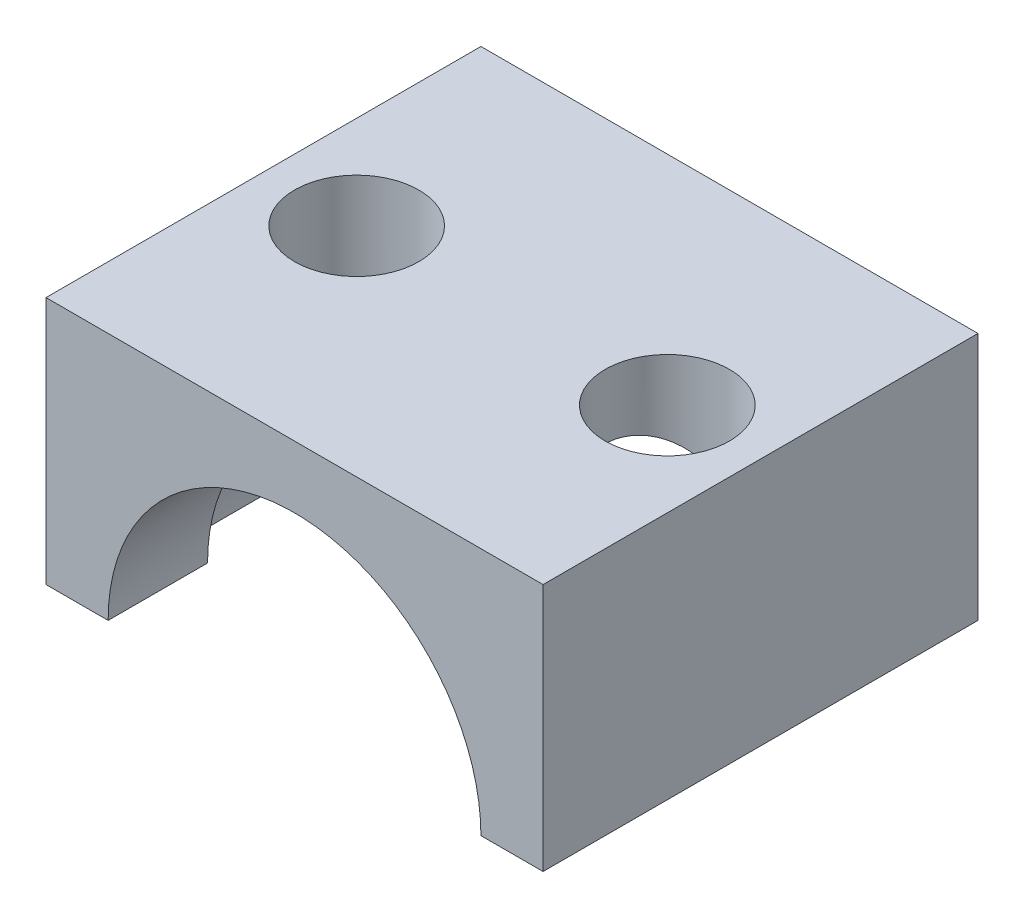
ISO-10303-21;
HEADER;
FILE_DESCRIPTION(('STEP AP214'),'2;1');
FILE_NAME('part.step','',(''),(''),'','','');
FILE_SCHEMA(('AUTOMOTIVE_DESIGN { 1 0 10303 214 1 1 1 1 }'));
ENDSEC;
DATA;
#1=APPLICATION_CONTEXT('core data for automotive mechanical design processes');
#2=APPLICATION_PROTOCOL_DEFINITION('international standard','automotive_design',2000,#1);
#3=PRODUCT_CONTEXT('',#1,'mechanical');
#4=PRODUCT('Part','Part','',(#3));
#5=PRODUCT_RELATED_PRODUCT_CATEGORY('part','',(#4));
#6=PRODUCT_DEFINITION_FORMATION('','',#4);
#7=PRODUCT_DEFINITION_CONTEXT('part definition',#1,'design');
#8=PRODUCT_DEFINITION('design','',#6,#7);
#9=PRODUCT_DEFINITION_SHAPE('','',#8);
#10=(LENGTH_UNIT() NAMED_UNIT(*) SI_UNIT(.MILLI.,.METRE.));
#11=(NAMED_UNIT(*) PLANE_ANGLE_UNIT() SI_UNIT($,.RADIAN.));
#12=(NAMED_UNIT(*) SI_UNIT($,.STERADIAN.) SOLID_ANGLE_UNIT());
#13=UNCERTAINTY_MEASURE_WITH_UNIT(LENGTH_MEASURE(1.E-05),#10,'distance_accuracy_value','');
#14=(GEOMETRIC_REPRESENTATION_CONTEXT(3) GLOBAL_UNCERTAINTY_ASSIGNED_CONTEXT((#13)) GLOBAL_UNIT_ASSIGNED_CONTEXT((#10,
#11,#12)) REPRESENTATION_CONTEXT('',''));
#15=CARTESIAN_POINT('',(0.,0.,0.));
#16=DIRECTION('',(0.,0.,1.));
#17=DIRECTION('',(1.,0.,0.));
#18=AXIS2_PLACEMENT_3D('',#15,#16,#17);
#19=CARTESIAN_POINT('',(0.,0.,14.));
#20=DIRECTION('',(0.,0.,-1.));
#21=DIRECTION('',(-1.,0.,0.));
#22=AXIS2_PLACEMENT_3D('',#19,#20,#21);
#23=CYLINDRICAL_SURFACE('',#22,6.);
#24=CARTESIAN_POINT('',(0.,0.,3.2));
#25=DIRECTION('',(0.,0.,1.));
#26=DIRECTION('',(1.,0.,0.));
#27=AXIS2_PLACEMENT_3D('',#24,#25,#26);
#28=CIRCLE('',#27,6.);
#29=CARTESIAN_POINT('',(-6.,0.,3.2));
#30=VERTEX_POINT('',#29);
#31=CARTESIAN_POINT('',(6.,0.,3.2));
#32=VERTEX_POINT('',#31);
#33=EDGE_CURVE('E215',#30,#32,#28,.F.);
#34=ORIENTED_EDGE('',*,*,#33,.F.);
#35=DIRECTION('',(0.,0.,-1.));
#36=VECTOR('',#35,1.);
#37=CARTESIAN_POINT('',(-6.,0.,14.));
#38=LINE('',#37,#36);
#39=CARTESIAN_POINT('',(-6.,0.,0.));
#40=VERTEX_POINT('',#39);
#41=EDGE_CURVE('E202',#30,#40,#38,.T.);
#42=ORIENTED_EDGE('',*,*,#41,.T.);
#43=CARTESIAN_POINT('',(0.,0.,0.));
#44=DIRECTION('',(0.,0.,-1.));
#45=DIRECTION('',(1.,0.,0.));
#46=AXIS2_PLACEMENT_3D('',#43,#44,#45);
#47=CIRCLE('',#46,6.);
#48=CARTESIAN_POINT('',(6.,0.,0.));
#49=VERTEX_POINT('',#48);
#50=EDGE_CURVE('E221',#40,#49,#47,.T.);
#51=ORIENTED_EDGE('',*,*,#50,.T.);
#52=DIRECTION('',(0.,0.,-1.));
#53=VECTOR('',#52,1.);
#54=CARTESIAN_POINT('',(6.,0.,14.));
#55=LINE('',#54,#53);
#56=EDGE_CURVE('E217',#32,#49,#55,.T.);
#57=ORIENTED_EDGE('',*,*,#56,.F.);
#58=EDGE_LOOP('',(#34,#42,#51,#57));
#59=FACE_BOUND('',#58,.T.);
#60=ADVANCED_FACE('F31',(#59),#23,.F.);
#61=CARTESIAN_POINT('',(8.,8.,14.));
#62=DIRECTION('',(0.,-1.,0.));
#63=DIRECTION('',(0.,0.,-1.));
#64=AXIS2_PLACEMENT_3D('',#61,#62,#63);
#65=PLANE('',#64);
#66=CARTESIAN_POINT('',(5.,8.,7.));
#67=DIRECTION('',(0.,1.,0.));
#68=DIRECTION('',(0.,0.,1.));
#69=AXIS2_PLACEMENT_3D('',#66,#67,#68);
#70=CIRCLE('',#69,2.);
#71=CARTESIAN_POINT('',(5.,8.,9.));
#72=VERTEX_POINT('',#71);
#73=EDGE_CURVE('E134',#72,#72,#70,.T.);
#74=ORIENTED_EDGE('',*,*,#73,.F.);
#75=EDGE_LOOP('',(#74));
#76=FACE_BOUND('',#75,.T.);
#77=CARTESIAN_POINT('',(-5.,8.,7.));
#78=DIRECTION('',(0.,1.,0.));
#79=DIRECTION('',(0.,0.,1.));
#80=AXIS2_PLACEMENT_3D('',#77,#78,#79);
#81=CIRCLE('',#80,2.);
#82=CARTESIAN_POINT('',(-5.,8.,9.));
#83=VERTEX_POINT('',#82);
#84=EDGE_CURVE('E133',#83,#83,#81,.T.);
#85=ORIENTED_EDGE('',*,*,#84,.F.);
#86=EDGE_LOOP('',(#85));
#87=FACE_BOUND('',#86,.T.);
#88=DIRECTION('',(-1.,0.,0.));
#89=VECTOR('',#88,1.);
#90=CARTESIAN_POINT('',(8.,8.,0.));
#91=LINE('',#90,#89);
#92=CARTESIAN_POINT('',(8.,8.,0.));
#93=VERTEX_POINT('',#92);
#94=CARTESIAN_POINT('',(-8.,8.,0.));
#95=VERTEX_POINT('',#94);
#96=EDGE_CURVE('E245',#93,#95,#91,.T.);
#97=ORIENTED_EDGE('',*,*,#96,.T.);
#98=DIRECTION('',(0.,0.,-1.));
#99=VECTOR('',#98,1.);
#100=CARTESIAN_POINT('',(-8.,8.,14.));
#101=LINE('',#100,#99);
#102=CARTESIAN_POINT('',(-8.,8.,14.));
#103=VERTEX_POINT('',#102);
#104=EDGE_CURVE('E205',#103,#95,#101,.T.);
#105=ORIENTED_EDGE('',*,*,#104,.F.);
#106=DIRECTION('',(-1.,0.,0.));
#107=VECTOR('',#106,1.);
#108=CARTESIAN_POINT('',(8.,8.,14.));
#109=LINE('',#108,#107);
#110=CARTESIAN_POINT('',(8.,8.,14.));
#111=VERTEX_POINT('',#110);
#112=EDGE_CURVE('E236',#111,#103,#109,.T.);
#113=ORIENTED_EDGE('',*,*,#112,.F.);
#114=DIRECTION('',(0.,0.,-1.));
#115=VECTOR('',#114,1.);
#116=CARTESIAN_POINT('',(8.,8.,14.));
#117=LINE('',#116,#115);
#118=EDGE_CURVE('E225',#111,#93,#117,.T.);
#119=ORIENTED_EDGE('',*,*,#118,.T.);
#120=EDGE_LOOP('',(#97,#105,#113,#119));
#121=FACE_BOUND('',#120,.T.);
#122=ADVANCED_FACE('F33',(#76,#87,#121),#65,.F.);
#123=CARTESIAN_POINT('',(-8.,0.,14.));
#124=DIRECTION('',(1.,0.,0.));
#125=DIRECTION('',(0.,0.,-1.));
#126=AXIS2_PLACEMENT_3D('',#123,#124,#125);
#127=PLANE('',#126);
#128=DIRECTION('',(0.,-1.,0.));
#129=VECTOR('',#128,1.);
#130=CARTESIAN_POINT('',(-8.,0.,0.));
#131=LINE('',#130,#129);
#132=CARTESIAN_POINT('',(-8.,0.,0.));
#133=VERTEX_POINT('',#132);
#134=EDGE_CURVE('E243',#95,#133,#131,.T.);
#135=ORIENTED_EDGE('',*,*,#134,.T.);
#136=DIRECTION('',(0.,0.,-1.));
#137=VECTOR('',#136,1.);
#138=CARTESIAN_POINT('',(-8.,0.,14.));
#139=LINE('',#138,#137);
#140=CARTESIAN_POINT('',(-8.,0.,14.));
#141=VERTEX_POINT('',#140);
#142=EDGE_CURVE('E201',#141,#133,#139,.T.);
#143=ORIENTED_EDGE('',*,*,#142,.F.);
#144=DIRECTION('',(0.,-1.,0.));
#145=VECTOR('',#144,1.);
#146=CARTESIAN_POINT('',(-8.,0.,14.));
#147=LINE('',#146,#145);
#148=EDGE_CURVE('E254',#103,#141,#147,.T.);
#149=ORIENTED_EDGE('',*,*,#148,.F.);
#150=ORIENTED_EDGE('',*,*,#104,.T.);
#151=EDGE_LOOP('',(#135,#143,#149,#150));
#152=FACE_BOUND('',#151,.T.);
#153=ADVANCED_FACE('F176',(#152),#127,.F.);
#154=CARTESIAN_POINT('',(-6.,0.,14.));
#155=DIRECTION('',(0.,1.,0.));
#156=DIRECTION('',(-1.,0.,0.));
#157=AXIS2_PLACEMENT_3D('',#154,#155,#156);
#158=PLANE('',#157);
#159=DIRECTION('',(0.,0.,-1.));
#160=VECTOR('',#159,1.);
#161=CARTESIAN_POINT('',(-6.9885699723544,0.,10.8));
#162=LINE('',#161,#160);
#163=CARTESIAN_POINT('',(-6.9885699723544,0.,6.78648310359493));
#164=VERTEX_POINT('',#163);
#165=CARTESIAN_POINT('',(-6.9885699723544,0.,3.2));
#166=VERTEX_POINT('',#165);
#167=EDGE_CURVE('E260',#164,#166,#162,.T.);
#168=ORIENTED_EDGE('',*,*,#167,.F.);
#169=CARTESIAN_POINT('',(-5.,0.,7.));
#170=DIRECTION('',(0.,1.,0.));
#171=DIRECTION('',(0.,0.,1.));
#172=AXIS2_PLACEMENT_3D('',#169,#170,#171);
#173=CIRCLE('',#172,2.);
#174=CARTESIAN_POINT('',(-6.98856997235439,0.,7.21351689640507));
#175=VERTEX_POINT('',#174);
#176=EDGE_CURVE('E56',#164,#175,#173,.T.);
#177=ORIENTED_EDGE('',*,*,#176,.T.);
#178=CARTESIAN_POINT('',(-6.9885699723544,0.,10.8));
#179=VERTEX_POINT('',#178);
#180=EDGE_CURVE('E247',#179,#175,#162,.T.);
#181=ORIENTED_EDGE('',*,*,#180,.F.);
#182=DIRECTION('',(1.,0.,0.));
#183=VECTOR('',#182,1.);
#184=CARTESIAN_POINT('',(-6.,0.,10.8));
#185=LINE('',#184,#183);
#186=CARTESIAN_POINT('',(-6.,0.,10.8));
#187=VERTEX_POINT('',#186);
#188=EDGE_CURVE('E261',#179,#187,#185,.T.);
#189=ORIENTED_EDGE('',*,*,#188,.T.);
#190=CARTESIAN_POINT('',(-6.,0.,14.));
#191=VERTEX_POINT('',#190);
#192=EDGE_CURVE('E194',#191,#187,#38,.T.);
#193=ORIENTED_EDGE('',*,*,#192,.F.);
#194=DIRECTION('',(1.,0.,0.));
#195=VECTOR('',#194,1.);
#196=CARTESIAN_POINT('',(-6.,0.,14.));
#197=LINE('',#196,#195);
#198=EDGE_CURVE('E252',#141,#191,#197,.T.);
#199=ORIENTED_EDGE('',*,*,#198,.F.);
#200=ORIENTED_EDGE('',*,*,#142,.T.);
#201=DIRECTION('',(1.,0.,0.));
#202=VECTOR('',#201,1.);
#203=CARTESIAN_POINT('',(-6.,0.,0.));
#204=LINE('',#203,#202);
#205=EDGE_CURVE('E240',#133,#40,#204,.T.);
#206=ORIENTED_EDGE('',*,*,#205,.T.);
#207=ORIENTED_EDGE('',*,*,#41,.F.);
#208=DIRECTION('',(1.,0.,0.));
#209=VECTOR('',#208,1.);
#210=CARTESIAN_POINT('',(-6.,0.,3.2));
#211=LINE('',#210,#209);
#212=EDGE_CURVE('E264',#166,#30,#211,.T.);
#213=ORIENTED_EDGE('',*,*,#212,.F.);
#214=EDGE_LOOP('',(#168,#177,#181,#189,#193,#199,#200,#206,#207,#213));
#215=FACE_BOUND('',#214,.T.);
#216=ADVANCED_FACE('F182',(#215),#158,.F.);
#217=ORIENTED_EDGE('',*,*,#192,.T.);
#218=CARTESIAN_POINT('',(0.,0.,10.8));
#219=DIRECTION('',(0.,0.,1.));
#220=DIRECTION('',(1.,0.,0.));
#221=AXIS2_PLACEMENT_3D('',#218,#219,#220);
#222=CIRCLE('',#221,6.);
#223=CARTESIAN_POINT('',(6.,0.,10.8));
#224=VERTEX_POINT('',#223);
#225=EDGE_CURVE('E196',#187,#224,#222,.F.);
#226=ORIENTED_EDGE('',*,*,#225,.T.);
#227=CARTESIAN_POINT('',(6.,0.,14.));
#228=VERTEX_POINT('',#227);
#229=EDGE_CURVE('E207',#228,#224,#55,.T.);
#230=ORIENTED_EDGE('',*,*,#229,.F.);
#231=CARTESIAN_POINT('',(0.,0.,14.));
#232=DIRECTION('',(0.,0.,-1.));
#233=DIRECTION('',(1.,0.,0.));
#234=AXIS2_PLACEMENT_3D('',#231,#232,#233);
#235=CIRCLE('',#234,6.);
#236=EDGE_CURVE('E198',#191,#228,#235,.T.);
#237=ORIENTED_EDGE('',*,*,#236,.F.);
#238=EDGE_LOOP('',(#217,#226,#230,#237));
#239=FACE_BOUND('',#238,.T.);
#240=ADVANCED_FACE('F172',(#239),#23,.F.);
#241=CARTESIAN_POINT('',(8.,0.,14.));
#242=DIRECTION('',(0.,1.,0.));
#243=DIRECTION('',(-1.,0.,0.));
#244=AXIS2_PLACEMENT_3D('',#241,#242,#243);
#245=PLANE('',#244);
#246=DIRECTION('',(0.,0.,-1.));
#247=VECTOR('',#246,1.);
#248=CARTESIAN_POINT('',(6.98856997235439,0.,10.8));
#249=LINE('',#248,#247);
#250=CARTESIAN_POINT('',(6.98856997235439,0.,7.21351689640506));
#251=VERTEX_POINT('',#250);
#252=CARTESIAN_POINT('',(6.9885699723544,0.,10.8));
#253=VERTEX_POINT('',#252);
#254=EDGE_CURVE('E132',#251,#253,#249,.F.);
#255=ORIENTED_EDGE('',*,*,#254,.F.);
#256=CARTESIAN_POINT('',(5.,0.,7.));
#257=DIRECTION('',(0.,1.,0.));
#258=DIRECTION('',(0.,0.,1.));
#259=AXIS2_PLACEMENT_3D('',#256,#257,#258);
#260=CIRCLE('',#259,2.);
#261=CARTESIAN_POINT('',(6.98856997235439,0.,6.78648310359494));
#262=VERTEX_POINT('',#261);
#263=EDGE_CURVE('E49',#251,#262,#260,.T.);
#264=ORIENTED_EDGE('',*,*,#263,.T.);
#265=CARTESIAN_POINT('',(6.9885699723544,0.,3.2));
#266=VERTEX_POINT('',#265);
#267=EDGE_CURVE('E130',#266,#262,#249,.F.);
#268=ORIENTED_EDGE('',*,*,#267,.F.);
#269=DIRECTION('',(1.,0.,0.));
#270=VECTOR('',#269,1.);
#271=CARTESIAN_POINT('',(8.,0.,3.2));
#272=LINE('',#271,#270);
#273=EDGE_CURVE('E143',#32,#266,#272,.T.);
#274=ORIENTED_EDGE('',*,*,#273,.F.);
#275=ORIENTED_EDGE('',*,*,#56,.T.);
#276=DIRECTION('',(1.,0.,0.));
#277=VECTOR('',#276,1.);
#278=CARTESIAN_POINT('',(8.,0.,0.));
#279=LINE('',#278,#277);
#280=CARTESIAN_POINT('',(8.,0.,0.));
#281=VERTEX_POINT('',#280);
#282=EDGE_CURVE('E237',#49,#281,#279,.T.);
#283=ORIENTED_EDGE('',*,*,#282,.T.);
#284=DIRECTION('',(0.,0.,-1.));
#285=VECTOR('',#284,1.);
#286=CARTESIAN_POINT('',(8.,0.,14.));
#287=LINE('',#286,#285);
#288=CARTESIAN_POINT('',(8.,0.,14.));
#289=VERTEX_POINT('',#288);
#290=EDGE_CURVE('E223',#289,#281,#287,.T.);
#291=ORIENTED_EDGE('',*,*,#290,.F.);
#292=DIRECTION('',(1.,0.,0.));
#293=VECTOR('',#292,1.);
#294=CARTESIAN_POINT('',(8.,0.,14.));
#295=LINE('',#294,#293);
#296=EDGE_CURVE('E249',#228,#289,#295,.T.);
#297=ORIENTED_EDGE('',*,*,#296,.F.);
#298=ORIENTED_EDGE('',*,*,#229,.T.);
#299=DIRECTION('',(1.,0.,0.));
#300=VECTOR('',#299,1.);
#301=CARTESIAN_POINT('',(8.,0.,10.8));
#302=LINE('',#301,#300);
#303=EDGE_CURVE('E140',#224,#253,#302,.T.);
#304=ORIENTED_EDGE('',*,*,#303,.T.);
#305=EDGE_LOOP('',(#255,#264,#268,#274,#275,#283,#291,#297,#298,#304));
#306=FACE_BOUND('',#305,.T.);
#307=ADVANCED_FACE('F128',(#306),#245,.F.);
#308=CARTESIAN_POINT('',(8.,8.,14.));
#309=DIRECTION('',(-1.,0.,0.));
#310=DIRECTION('',(0.,0.,1.));
#311=AXIS2_PLACEMENT_3D('',#308,#309,#310);
#312=PLANE('',#311);
#313=DIRECTION('',(0.,1.,0.));
#314=VECTOR('',#313,1.);
#315=CARTESIAN_POINT('',(8.,8.,0.));
#316=LINE('',#315,#314);
#317=EDGE_CURVE('E234',#281,#93,#316,.T.);
#318=ORIENTED_EDGE('',*,*,#317,.T.);
#319=ORIENTED_EDGE('',*,*,#118,.F.);
#320=DIRECTION('',(0.,1.,0.));
#321=VECTOR('',#320,1.);
#322=CARTESIAN_POINT('',(8.,8.,14.));
#323=LINE('',#322,#321);
#324=EDGE_CURVE('E231',#289,#111,#323,.T.);
#325=ORIENTED_EDGE('',*,*,#324,.F.);
#326=ORIENTED_EDGE('',*,*,#290,.T.);
#327=EDGE_LOOP('',(#318,#319,#325,#326));
#328=FACE_BOUND('',#327,.T.);
#329=ADVANCED_FACE('F188',(#328),#312,.F.);
#330=CARTESIAN_POINT('',(0.,0.,14.));
#331=DIRECTION('',(0.,0.,1.));
#332=DIRECTION('',(1.,0.,0.));
#333=AXIS2_PLACEMENT_3D('',#330,#331,#332);
#334=PLANE('',#333);
#335=ORIENTED_EDGE('',*,*,#112,.T.);
#336=ORIENTED_EDGE('',*,*,#148,.T.);
#337=ORIENTED_EDGE('',*,*,#198,.T.);
#338=ORIENTED_EDGE('',*,*,#236,.T.);
#339=ORIENTED_EDGE('',*,*,#296,.T.);
#340=ORIENTED_EDGE('',*,*,#324,.T.);
#341=EDGE_LOOP('',(#335,#336,#337,#338,#339,#340));
#342=FACE_BOUND('',#341,.T.);
#343=ADVANCED_FACE('F287',(#342),#334,.T.);
#344=CARTESIAN_POINT('',(0.,0.,0.));
#345=DIRECTION('',(0.,0.,1.));
#346=DIRECTION('',(1.,0.,0.));
#347=AXIS2_PLACEMENT_3D('',#344,#345,#346);
#348=PLANE('',#347);
#349=ORIENTED_EDGE('',*,*,#96,.F.);
#350=ORIENTED_EDGE('',*,*,#317,.F.);
#351=ORIENTED_EDGE('',*,*,#282,.F.);
#352=ORIENTED_EDGE('',*,*,#50,.F.);
#353=ORIENTED_EDGE('',*,*,#205,.F.);
#354=ORIENTED_EDGE('',*,*,#134,.F.);
#355=EDGE_LOOP('',(#349,#350,#351,#352,#353,#354));
#356=FACE_BOUND('',#355,.T.);
#357=ADVANCED_FACE('F167',(#356),#348,.F.);
#358=CARTESIAN_POINT('',(0.,-0.399862153130925,10.8));
#359=DIRECTION('',(0.,0.,-1.));
#360=DIRECTION('',(-1.,0.,0.));
#361=AXIS2_PLACEMENT_3D('',#358,#359,#360);
#362=CYLINDRICAL_SURFACE('',#361,7.);
#363=CARTESIAN_POINT('',(6.9885699723544,0.,7.21351689640505));
#364=CARTESIAN_POINT('',(6.98260913120736,0.10412939153972,7.26900453883635));
#365=CARTESIAN_POINT('',(6.97432266845988,0.208199831836068,7.32432891530317));
#366=CARTESIAN_POINT('',(6.95305836732511,0.416174694844384,7.43440568962025));
#367=CARTESIAN_POINT('',(6.94008012854597,0.520079102626939,7.48915803824375));
#368=CARTESIAN_POINT('',(6.89398302263735,0.831895165255373,7.65241059180628));
#369=CARTESIAN_POINT('',(6.85372726778979,1.03945691004163,7.75966313086402));
#370=CARTESIAN_POINT('',(6.75313483457679,1.45525500521469,7.96965688107877));
#371=CARTESIAN_POINT('',(6.69256541513152,1.66347010670329,8.07232941187542));
#372=CARTESIAN_POINT('',(6.55085383568995,2.07683274119668,8.26866003043093));
#373=CARTESIAN_POINT('',(6.46973626917217,2.28198363300012,8.36232871105015));
#374=CARTESIAN_POINT('',(6.27450249533815,2.71356003179651,8.54789555215075));
#375=CARTESIAN_POINT('',(6.15753691415539,2.93945809132244,8.63812455569497));
#376=CARTESIAN_POINT('',(5.96119657452937,3.27173528665829,8.75552658801256));
#377=CARTESIAN_POINT('',(5.89237219702752,3.38125933599831,8.79163452769481));
#378=CARTESIAN_POINT('',(5.74771078646395,3.59773528357848,8.85667025734741));
#379=CARTESIAN_POINT('',(5.67187564361848,3.70468786538549,8.88559997497853));
#380=CARTESIAN_POINT('',(5.47299703003023,3.96885020082581,8.94728852445968));
#381=CARTESIAN_POINT('',(5.34547341004999,4.12412455689504,8.97458582223754));
#382=CARTESIAN_POINT('',(5.14360177223228,4.3491966807459,8.99598213010263));
#383=CARTESIAN_POINT('',(5.07455456323997,4.42290691990769,8.99985657072733));
#384=CARTESIAN_POINT('',(4.93333567395592,4.56726831395393,9.00013564726777));
#385=CARTESIAN_POINT('',(4.86116506021105,4.63792049684307,8.99654281362724));
#386=CARTESIAN_POINT('',(4.68050358888609,4.80728863622298,8.97725680317642));
#387=CARTESIAN_POINT('',(4.57055585361447,4.90398956191869,8.95676382600984));
#388=CARTESIAN_POINT('',(4.34849475707033,5.08751110256859,8.89441112712339));
#389=CARTESIAN_POINT('',(4.23638446623435,5.17434467031863,8.8525798216641));
#390=CARTESIAN_POINT('',(4.03416192534216,5.32188654209605,8.75428149940972));
#391=CARTESIAN_POINT('',(3.94361221984567,5.38451263903453,8.70162062859542));
#392=CARTESIAN_POINT('',(3.76811222146935,5.50033862064287,8.57920167535289));
#393=CARTESIAN_POINT('',(3.68316020066841,5.55354142278347,8.5094489006087));
#394=CARTESIAN_POINT('',(3.52267168194763,5.64989999905107,8.35282727463397));
#395=CARTESIAN_POINT('',(3.44719578372863,5.69299250259215,8.26585660469605));
#396=CARTESIAN_POINT('',(3.31074545150061,5.76820608604411,8.07701662762166));
#397=CARTESIAN_POINT('',(3.24976528575922,5.80033150462968,7.97515323500825));
#398=CARTESIAN_POINT('',(3.1518407427755,5.85062600198729,7.7717666700209));
#399=CARTESIAN_POINT('',(3.11298934114896,5.86994217532816,7.67144059161352));
#400=CARTESIAN_POINT('',(3.05174594230749,5.89998104317376,7.46466880612839));
#401=CARTESIAN_POINT('',(3.0293480332058,5.91070682440822,7.35822531192987));
#402=CARTESIAN_POINT('',(3.00287743906421,5.92334331944303,7.14852852035564));
#403=CARTESIAN_POINT('',(2.99786993096218,5.92570386011227,7.04541891487748));
#404=CARTESIAN_POINT('',(3.00377815814397,5.92290058631981,6.83976820168921));
#405=CARTESIAN_POINT('',(3.01469147639051,5.91773791400286,6.73722701005697));
#406=CARTESIAN_POINT('',(3.05172837198066,5.89992857462022,6.53686075745006));
#407=CARTESIAN_POINT('',(3.07767285339231,5.88737000096285,6.43899460829624));
#408=CARTESIAN_POINT('',(3.14347749683438,5.85472726488432,6.24940510030129));
#409=CARTESIAN_POINT('',(3.18333725952567,5.83464331842421,6.15768156527015));
#410=CARTESIAN_POINT('',(3.27583753811654,5.78654462265319,5.98152325794004));
#411=CARTESIAN_POINT('',(3.32864453060972,5.75842570969756,5.89720460377266));
#412=CARTESIAN_POINT('',(3.44439729119712,5.69443764971341,5.73916663548438));
#413=CARTESIAN_POINT('',(3.50734427609204,5.65856757236732,5.66544859545076));
#414=CARTESIAN_POINT('',(3.64410111739515,5.5773569334595,5.52639193905743));
#415=CARTESIAN_POINT('',(3.71829814524534,5.53163072154503,5.46166142748348));
#416=CARTESIAN_POINT('',(3.87190167344389,5.43252472013083,5.34571220838826));
#417=CARTESIAN_POINT('',(3.95130990799556,5.37914237571925,5.29449802764184));
#418=CARTESIAN_POINT('',(4.12174672699999,5.25904743485629,5.20022026778671));
#419=CARTESIAN_POINT('',(4.21306861069467,5.19150904880293,5.1587496962348));
#420=CARTESIAN_POINT('',(4.39565139371452,5.04914435174364,5.09100497898739));
#421=CARTESIAN_POINT('',(4.48691221472181,4.97431332833407,5.06474073651203));
#422=CARTESIAN_POINT('',(4.64716580413569,4.83583029306908,5.03005877306018));
#423=CARTESIAN_POINT('',(4.7166289639392,4.77335475552805,5.01898196681511));
#424=CARTESIAN_POINT('',(4.85341559925027,4.64524991476008,5.00419287693035));
#425=CARTESIAN_POINT('',(4.92073812375174,4.57961924146759,5.00048382274639));
#426=CARTESIAN_POINT('',(5.11887053763536,4.37847547932562,4.99916338068851));
#427=CARTESIAN_POINT('',(5.24567353040603,4.2388588283026,5.01139128059642));
#428=CARTESIAN_POINT('',(5.45388452010664,3.9903625573064,5.05012225370716));
#429=CARTESIAN_POINT('',(5.53838198745438,3.88321225210228,5.071950234602));
#430=CARTESIAN_POINT('',(5.70005940226107,3.66556241475555,5.12459568746387));
#431=CARTESIAN_POINT('',(5.77723592850077,3.55506134825829,5.15541733519077));
#432=CARTESIAN_POINT('',(5.92421367865431,3.33131070023665,5.22449022723016));
#433=CARTESIAN_POINT('',(5.99400410849301,3.2180573856337,5.26275211939637));
#434=CARTESIAN_POINT('',(6.12617297291355,2.98945082296656,5.34536799716403));
#435=CARTESIAN_POINT('',(6.18854923512049,2.87409697079926,5.38972376012233));
#436=CARTESIAN_POINT('',(6.33479366751687,2.58476909998309,5.5063912834254));
#437=CARTESIAN_POINT('',(6.41421663546579,2.40976724305159,5.58175178254513));
#438=CARTESIAN_POINT('',(6.55742034452989,2.05706653827664,5.74067960611173));
#439=CARTESIAN_POINT('',(6.62119218562058,1.87936621665114,5.82425156236185));
#440=CARTESIAN_POINT('',(6.73357077423035,1.52213623693508,5.99731655115856));
#441=CARTESIAN_POINT('',(6.7821799877797,1.34260688122609,6.08680861799328));
#442=CARTESIAN_POINT('',(6.86466135386414,0.982364222775506,6.26985689597939));
#443=CARTESIAN_POINT('',(6.89854077699503,0.801651548933178,6.36341107693985));
#444=CARTESIAN_POINT('',(6.94045526710135,0.517198267713121,6.51235752393676));
#445=CARTESIAN_POINT('',(6.95334213265122,0.413700686415739,6.56690047962475));
#446=CARTESIAN_POINT('',(6.97443241415853,0.206820166839309,6.67640463446696));
#447=CARTESIAN_POINT('',(6.98264873611334,0.103437708285809,6.73136425162649));
#448=CARTESIAN_POINT('',(6.98856997235498,-7.29255519400714E-12,6.78648310358088));
#449=B_SPLINE_CURVE_WITH_KNOTS('',3,(#363,#364,#365,#366,#367,#368,#369,#370,#371,#372,#373,
#374,#375,#376,#377,#378,#379,#380,#381,#382,#383,#384,#385,#386,#387,#388,#389,#390,#391,#392,
#393,#394,#395,#396,#397,#398,#399,#400,#401,#402,#403,#404,#405,#406,#407,#408,#409,#410,#411,
#412,#413,#414,#415,#416,#417,#418,#419,#420,#421,#422,#423,#424,#425,#426,#427,#428,#429,#430,
#431,#432,#433,#434,#435,#436,#437,#438,#439,#440,#441,#442,#443,#444,#445,#446,#447,#448),
.UNSPECIFIED.,.F.,.F.,(4,2,2,2,2,2,2,2,2,2,2,2,2,2,2,2,2,2,2,2,2,2,2,2,2,2,2,2,2,2,2,2,2,2,2,2,
2,2,2,2,2,2,4),(0.,0.354376437138729,0.708783123577473,1.41913561469535,2.13792193720887,
2.85585199688706,3.66307387757566,4.0656251755573,4.46806825395201,5.07402123296143,
5.37693493679063,5.67974600864509,6.12163973061574,6.56294651287298,6.92757104934854,
7.29208249926432,7.65881760666105,8.02540746185689,8.3516397047487,8.67775467207219,
8.98604245143518,9.29428343262985,9.59892513012576,9.90355808576815,10.2123348520933,
10.5211486993195,10.8454979651373,11.1699557218045,11.5313731742129,11.8930257380789,
12.1748818427029,12.4568614641233,13.0214997096326,13.4355992550283,13.8498913736228,
14.2647808148126,14.67979152183,15.2981542985081,15.9168678970952,16.5354808163667,
17.1537880418852,17.5067979095283,17.8588275117978),.UNSPECIFIED.);
#450=EDGE_CURVE('E11',#251,#262,#449,.T.);
#451=ORIENTED_EDGE('',*,*,#450,.F.);
#452=ORIENTED_EDGE('',*,*,#254,.T.);
#453=CARTESIAN_POINT('',(0.,-0.399862153130925,10.8));
#454=DIRECTION('',(0.,0.,1.));
#455=DIRECTION('',(1.,0.,0.));
#456=AXIS2_PLACEMENT_3D('',#453,#454,#455);
#457=CIRCLE('',#456,7.);
#458=EDGE_CURVE('E267',#253,#179,#457,.T.);
#459=ORIENTED_EDGE('',*,*,#458,.T.);
#460=ORIENTED_EDGE('',*,*,#180,.T.);
#461=CARTESIAN_POINT('',(-6.9885699723544,0.,6.78648310359494));
#462=CARTESIAN_POINT('',(-6.98260913120736,0.104129391539722,6.73099546116364));
#463=CARTESIAN_POINT('',(-6.97432266845988,0.208199831836074,6.67567108469682));
#464=CARTESIAN_POINT('',(-6.95305836732511,0.416174694844394,6.56559431037974));
#465=CARTESIAN_POINT('',(-6.94008012854597,0.520079102626952,6.51084196175624));
#466=CARTESIAN_POINT('',(-6.89398302263734,0.831895165255392,6.34758940819371));
#467=CARTESIAN_POINT('',(-6.85372726778978,1.03945691004165,6.24033686913597));
#468=CARTESIAN_POINT('',(-6.75313483457678,1.45525500521472,6.03034311892122));
#469=CARTESIAN_POINT('',(-6.69256541513151,1.66347010670332,5.92767058812457));
#470=CARTESIAN_POINT('',(-6.55085383568993,2.07683274119672,5.73133996956906));
#471=CARTESIAN_POINT('',(-6.46973626917215,2.28198363300017,5.63767128894983));
#472=CARTESIAN_POINT('',(-6.27450249533813,2.71356003179655,5.45210444784924));
#473=CARTESIAN_POINT('',(-6.15753691415537,2.93945809132248,5.36187544430502));
#474=CARTESIAN_POINT('',(-5.96119657452936,3.27173528665831,5.24447341198743));
#475=CARTESIAN_POINT('',(-5.8923721970275,3.38125933599834,5.20836547230519));
#476=CARTESIAN_POINT('',(-5.74771078646393,3.5977352835785,5.14332974265259));
#477=CARTESIAN_POINT('',(-5.67187564361847,3.70468786538551,5.11440002502146));
#478=CARTESIAN_POINT('',(-5.47299703003022,3.96885020082583,5.05271147554032));
#479=CARTESIAN_POINT('',(-5.34547341004998,4.12412455689505,5.02541417776247));
#480=CARTESIAN_POINT('',(-5.14360177223227,4.34919668074591,5.00401786989737));
#481=CARTESIAN_POINT('',(-5.07455456323996,4.4229069199077,5.00014342927267));
#482=CARTESIAN_POINT('',(-4.93333567395591,4.56726831395394,4.99986435273223));
#483=CARTESIAN_POINT('',(-4.86116506021104,4.63792049684308,5.00345718637277));
#484=CARTESIAN_POINT('',(-4.68050358888608,4.80728863622299,5.02274319682359));
#485=CARTESIAN_POINT('',(-4.57055585361446,4.9039895619187,5.04323617399016));
#486=CARTESIAN_POINT('',(-4.34849475707032,5.0875111025686,5.10558887287661));
#487=CARTESIAN_POINT('',(-4.23638446623434,5.17434467031864,5.14742017833591));
#488=CARTESIAN_POINT('',(-4.03416192534215,5.32188654209606,5.24571850059029));
#489=CARTESIAN_POINT('',(-3.94361221984566,5.38451263903454,5.29837937140459));
#490=CARTESIAN_POINT('',(-3.76811222146934,5.50033862064288,5.42079832464712));
#491=CARTESIAN_POINT('',(-3.6831602006684,5.55354142278348,5.49055109939131));
#492=CARTESIAN_POINT('',(-3.52267168194762,5.64989999905108,5.64717272536604));
#493=CARTESIAN_POINT('',(-3.44719578372863,5.69299250259215,5.73414339530396));
#494=CARTESIAN_POINT('',(-3.3107454515006,5.76820608604412,5.92298337237835));
#495=CARTESIAN_POINT('',(-3.24976528575922,5.80033150462969,6.02484676499176));
#496=CARTESIAN_POINT('',(-3.15184074277549,5.85062600198729,6.22823332997912));
#497=CARTESIAN_POINT('',(-3.11298934114895,5.86994217532817,6.3285594083865));
#498=CARTESIAN_POINT('',(-3.05174594230748,5.89998104317376,6.53533119387163));
#499=CARTESIAN_POINT('',(-3.0293480332058,5.91070682440822,6.64177468807015));
#500=CARTESIAN_POINT('',(-3.00287743906421,5.92334331944303,6.85147147964438));
#501=CARTESIAN_POINT('',(-2.99786993096218,5.92570386011227,6.95458108512254));
#502=CARTESIAN_POINT('',(-3.00377815814397,5.92290058631981,7.16023179831081));
#503=CARTESIAN_POINT('',(-3.01469147639052,5.91773791400286,7.26277298994305));
#504=CARTESIAN_POINT('',(-3.05172837198066,5.89992857462022,7.46313924254995));
#505=CARTESIAN_POINT('',(-3.07767285339232,5.88737000096285,7.56100539170377));
#506=CARTESIAN_POINT('',(-3.14347749683439,5.85472726488431,7.75059489969873));
#507=CARTESIAN_POINT('',(-3.18333725952567,5.8346433184242,7.84231843472986));
#508=CARTESIAN_POINT('',(-3.27583753811655,5.78654462265319,8.01847674205998));
#509=CARTESIAN_POINT('',(-3.32864453060973,5.75842570969755,8.10279539622735));
#510=CARTESIAN_POINT('',(-3.44439729119713,5.6944376497134,8.26083336451563));
#511=CARTESIAN_POINT('',(-3.50734427609205,5.65856757236732,8.33455140454925));
#512=CARTESIAN_POINT('',(-3.64410111739515,5.57735693345949,8.47360806094257));
#513=CARTESIAN_POINT('',(-3.71829814524535,5.53163072154502,8.53833857251653));
#514=CARTESIAN_POINT('',(-3.8719016734439,5.43252472013082,8.65428779161175));
#515=CARTESIAN_POINT('',(-3.95130990799557,5.37914237571925,8.70550197235817));
#516=CARTESIAN_POINT('',(-4.121746727,5.25904743485629,8.7997797322133));
#517=CARTESIAN_POINT('',(-4.21306861069468,5.19150904880292,8.84125030376521));
#518=CARTESIAN_POINT('',(-4.39565139371454,5.04914435174363,8.90899502101262));
#519=CARTESIAN_POINT('',(-4.48691221472182,4.97431332833406,8.93525926348797));
#520=CARTESIAN_POINT('',(-4.64716580413571,4.83583029306907,8.96994122693982));
#521=CARTESIAN_POINT('',(-4.71662896393921,4.77335475552804,8.98101803318489));
#522=CARTESIAN_POINT('',(-4.85341559925028,4.64524991476007,8.99580712306965));
#523=CARTESIAN_POINT('',(-4.92073812375175,4.57961924146758,8.99951617725361));
#524=CARTESIAN_POINT('',(-5.11887053763538,4.37847547932561,9.00083661931149));
#525=CARTESIAN_POINT('',(-5.24567353040604,4.23885882830259,8.98860871940358));
#526=CARTESIAN_POINT('',(-5.45388452010665,3.99036255730638,8.94987774629284));
#527=CARTESIAN_POINT('',(-5.53838198745439,3.88321225210226,8.928049765398));
#528=CARTESIAN_POINT('',(-5.70005940226108,3.66556241475553,8.87540431253612));
#529=CARTESIAN_POINT('',(-5.77723592850078,3.55506134825827,8.84458266480923));
#530=CARTESIAN_POINT('',(-5.92421367865432,3.33131070023663,8.77550977276984));
#531=CARTESIAN_POINT('',(-5.99400410849303,3.21805738563367,8.73724788060363));
#532=CARTESIAN_POINT('',(-6.12617297291356,2.98945082296653,8.65463200283597));
#533=CARTESIAN_POINT('',(-6.1885492351205,2.87409697079924,8.61027623987766));
#534=CARTESIAN_POINT('',(-6.33479366751689,2.58476909998306,8.4936087165746));
#535=CARTESIAN_POINT('',(-6.41421663546581,2.40976724305156,8.41824821745486));
#536=CARTESIAN_POINT('',(-6.5574203445299,2.05706653827661,8.25932039388826));
#537=CARTESIAN_POINT('',(-6.62119218562059,1.87936621665111,8.17574843763813));
#538=CARTESIAN_POINT('',(-6.73357077423036,1.52213623693504,8.00268344884143));
#539=CARTESIAN_POINT('',(-6.78217998777972,1.34260688122605,7.91319138200671));
#540=CARTESIAN_POINT('',(-6.86466135386415,0.982364222775464,7.73014310402059));
#541=CARTESIAN_POINT('',(-6.89854077699504,0.801651548933135,7.63658892306013));
#542=CARTESIAN_POINT('',(-6.94045526710135,0.517198267713085,7.48764247606324));
#543=CARTESIAN_POINT('',(-6.95334213265122,0.41370068641571,7.43309952037524));
#544=CARTESIAN_POINT('',(-6.97443241415853,0.206820166839296,7.32359536553304));
#545=CARTESIAN_POINT('',(-6.98264873611334,0.103437708285803,7.26863574837353));
#546=CARTESIAN_POINT('',(-6.98856997235498,-7.29176056977593E-12,7.21351689641914));
#547=B_SPLINE_CURVE_WITH_KNOTS('',3,(#461,#462,#463,#464,#465,#466,#467,#468,#469,#470,#471,
#472,#473,#474,#475,#476,#477,#478,#479,#480,#481,#482,#483,#484,#485,#486,#487,#488,#489,#490,
#491,#492,#493,#494,#495,#496,#497,#498,#499,#500,#501,#502,#503,#504,#505,#506,#507,#508,#509,
#510,#511,#512,#513,#514,#515,#516,#517,#518,#519,#520,#521,#522,#523,#524,#525,#526,#527,#528,
#529,#530,#531,#532,#533,#534,#535,#536,#537,#538,#539,#540,#541,#542,#543,#544,#545,#546),
.UNSPECIFIED.,.F.,.F.,(4,2,2,2,2,2,2,2,2,2,2,2,2,2,2,2,2,2,2,2,2,2,2,2,2,2,2,2,2,2,2,2,2,2,2,2,
2,2,2,2,2,2,4),(0.,0.354376437138735,0.708783123577484,1.41913561469537,2.13792193720891,
2.85585199688711,3.66307387757568,4.06562517555732,4.46806825395203,5.07402123296145,
5.37693493679064,5.6797460086451,6.12163973061574,6.56294651287299,6.92757104934855,
7.29208249926432,7.65881760666106,8.02540746185689,8.35163970474871,8.67775467207219,
8.98604245143519,9.29428343262986,9.59892513012576,9.90355808576816,10.2123348520933,
10.5211486993195,10.8454979651373,11.1699557218045,11.5313731742129,11.8930257380789,
12.1748818427029,12.4568614641233,13.0214997096326,13.4355992550283,13.8498913736228,
14.2647808148126,14.67979152183,15.2981542985081,15.9168678970952,16.5354808163667,
17.1537880418853,17.5067979095283,17.8588275117978),.UNSPECIFIED.);
#548=EDGE_CURVE('E44',#164,#175,#547,.T.);
#549=ORIENTED_EDGE('',*,*,#548,.F.);
#550=ORIENTED_EDGE('',*,*,#167,.T.);
#551=CARTESIAN_POINT('',(0.,-0.399862153130925,3.2));
#552=DIRECTION('',(0.,0.,1.));
#553=DIRECTION('',(1.,0.,0.));
#554=AXIS2_PLACEMENT_3D('',#551,#552,#553);
#555=CIRCLE('',#554,7.);
#556=EDGE_CURVE('E139',#266,#166,#555,.T.);
#557=ORIENTED_EDGE('',*,*,#556,.F.);
#558=ORIENTED_EDGE('',*,*,#267,.T.);
#559=EDGE_LOOP('',(#451,#452,#459,#460,#549,#550,#557,#558));
#560=FACE_BOUND('',#559,.T.);
#561=ADVANCED_FACE('F137',(#560),#362,.F.);
#562=CARTESIAN_POINT('',(0.,-0.399862153130925,10.8));
#563=DIRECTION('',(0.,0.,1.));
#564=DIRECTION('',(1.,0.,0.));
#565=AXIS2_PLACEMENT_3D('',#562,#563,#564);
#566=PLANE('',#565);
#567=ORIENTED_EDGE('',*,*,#458,.F.);
#568=ORIENTED_EDGE('',*,*,#303,.F.);
#569=ORIENTED_EDGE('',*,*,#225,.F.);
#570=ORIENTED_EDGE('',*,*,#188,.F.);
#571=EDGE_LOOP('',(#567,#568,#569,#570));
#572=FACE_BOUND('',#571,.T.);
#573=ADVANCED_FACE('F160',(#572),#566,.F.);
#574=CARTESIAN_POINT('',(0.,-0.399862153130925,3.2));
#575=DIRECTION('',(0.,0.,1.));
#576=DIRECTION('',(1.,0.,0.));
#577=AXIS2_PLACEMENT_3D('',#574,#575,#576);
#578=PLANE('',#577);
#579=ORIENTED_EDGE('',*,*,#212,.T.);
#580=ORIENTED_EDGE('',*,*,#33,.T.);
#581=ORIENTED_EDGE('',*,*,#273,.T.);
#582=ORIENTED_EDGE('',*,*,#556,.T.);
#583=EDGE_LOOP('',(#579,#580,#581,#582));
#584=FACE_BOUND('',#583,.T.);
#585=ADVANCED_FACE('F157',(#584),#578,.T.);
#586=CARTESIAN_POINT('',(-5.,0.,7.));
#587=DIRECTION('',(0.,1.,0.));
#588=DIRECTION('',(0.,0.,1.));
#589=AXIS2_PLACEMENT_3D('',#586,#587,#588);
#590=CYLINDRICAL_SURFACE('',#589,2.);
#591=ORIENTED_EDGE('',*,*,#548,.T.);
#592=ORIENTED_EDGE('',*,*,#176,.F.);
#593=EDGE_LOOP('',(#591,#592));
#594=FACE_BOUND('',#593,.T.);
#595=ORIENTED_EDGE('',*,*,#84,.T.);
#596=EDGE_LOOP('',(#595));
#597=FACE_BOUND('',#596,.T.);
#598=ADVANCED_FACE('F153',(#594,#597),#590,.F.);
#599=CARTESIAN_POINT('',(5.,0.,7.));
#600=DIRECTION('',(0.,1.,0.));
#601=DIRECTION('',(0.,0.,1.));
#602=AXIS2_PLACEMENT_3D('',#599,#600,#601);
#603=CYLINDRICAL_SURFACE('',#602,2.);
#604=ORIENTED_EDGE('',*,*,#450,.T.);
#605=ORIENTED_EDGE('',*,*,#263,.F.);
#606=EDGE_LOOP('',(#604,#605));
#607=FACE_BOUND('',#606,.T.);
#608=ORIENTED_EDGE('',*,*,#73,.T.);
#609=EDGE_LOOP('',(#608));
#610=FACE_BOUND('',#609,.T.);
#611=ADVANCED_FACE('F121',(#607,#610),#603,.F.);
#612=CLOSED_SHELL('',(#60,#122,#153,#216,#240,#307,#329,#343,#357,#561,#573,#585,#598,#611));
#613=MANIFOLD_SOLID_BREP('B2',#612);
#614=ADVANCED_BREP_SHAPE_REPRESENTATION('',(#18,#613),#14);
#615=SHAPE_DEFINITION_REPRESENTATION(#9,#614);
ENDSEC;
END-ISO-10303-21;
